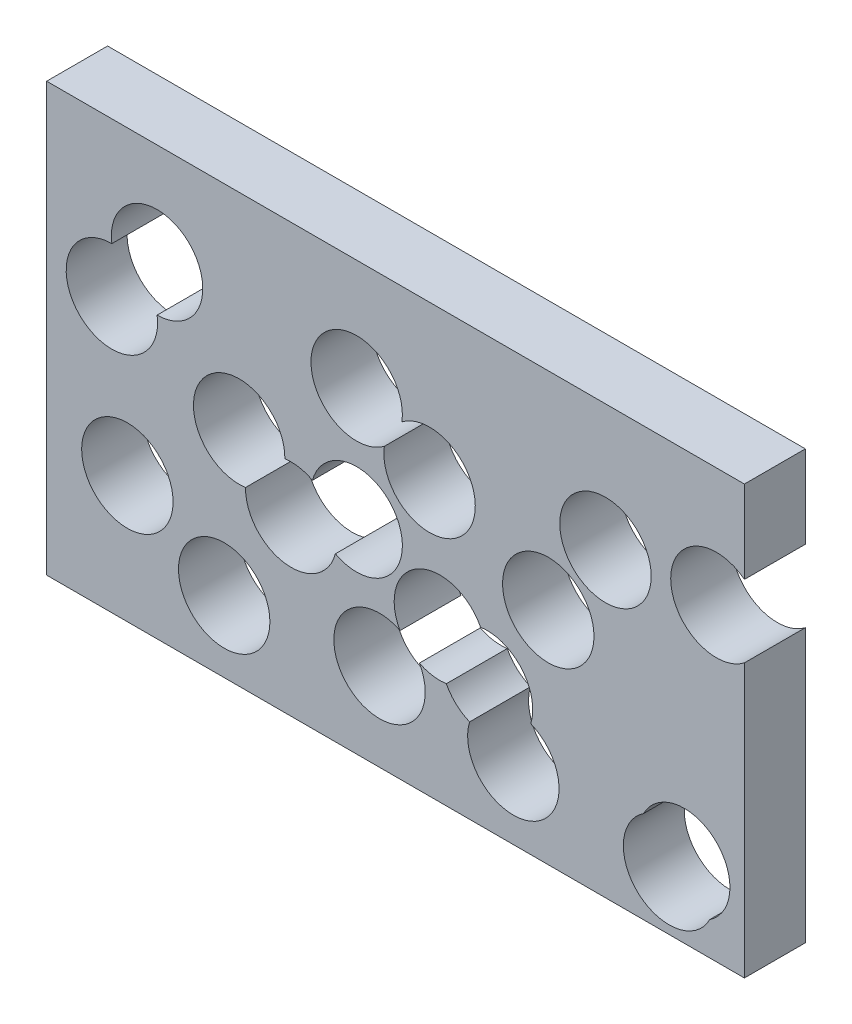
ISO-10303-21;
HEADER;
FILE_DESCRIPTION(('STEP AP214'),'2;1');
FILE_NAME('part.step','',(''),(''),'','','');
FILE_SCHEMA(('AUTOMOTIVE_DESIGN { 1 0 10303 214 1 1 1 1 }'));
ENDSEC;
DATA;
#1=APPLICATION_CONTEXT('core data for automotive mechanical design processes');
#2=APPLICATION_PROTOCOL_DEFINITION('international standard','automotive_design',2000,#1);
#3=PRODUCT_CONTEXT('',#1,'mechanical');
#4=PRODUCT('Part','Part','',(#3));
#5=PRODUCT_RELATED_PRODUCT_CATEGORY('part','',(#4));
#6=PRODUCT_DEFINITION_FORMATION('','',#4);
#7=PRODUCT_DEFINITION_CONTEXT('part definition',#1,'design');
#8=PRODUCT_DEFINITION('design','',#6,#7);
#9=PRODUCT_DEFINITION_SHAPE('','',#8);
#10=(LENGTH_UNIT() NAMED_UNIT(*) SI_UNIT(.MILLI.,.METRE.));
#11=(NAMED_UNIT(*) PLANE_ANGLE_UNIT() SI_UNIT($,.RADIAN.));
#12=(NAMED_UNIT(*) SI_UNIT($,.STERADIAN.) SOLID_ANGLE_UNIT());
#13=UNCERTAINTY_MEASURE_WITH_UNIT(LENGTH_MEASURE(1.E-05),#10,'distance_accuracy_value','');
#14=(GEOMETRIC_REPRESENTATION_CONTEXT(3) GLOBAL_UNCERTAINTY_ASSIGNED_CONTEXT((#13)) GLOBAL_UNIT_ASSIGNED_CONTEXT((#10,
#11,#12)) REPRESENTATION_CONTEXT('',''));
#15=CARTESIAN_POINT('',(0.,0.,0.));
#16=DIRECTION('',(0.,0.,1.));
#17=DIRECTION('',(1.,0.,0.));
#18=AXIS2_PLACEMENT_3D('',#15,#16,#17);
#19=CARTESIAN_POINT('',(57.2495238095238,35.1009523809524,10.));
#20=DIRECTION('',(-1.,0.,0.));
#21=DIRECTION('',(0.,0.,1.));
#22=AXIS2_PLACEMENT_3D('',#19,#20,#21);
#23=PLANE('',#22);
#24=DIRECTION('',(0.,1.,0.));
#25=VECTOR('',#24,1.);
#26=CARTESIAN_POINT('',(57.2495238095238,35.1009523809524,10.));
#27=LINE('',#26,#25);
#28=CARTESIAN_POINT('',(57.2495238095238,21.5401717013044,10.));
#29=VERTEX_POINT('',#28);
#30=CARTESIAN_POINT('',(57.2495238095238,35.1009523809524,10.));
#31=VERTEX_POINT('',#30);
#32=EDGE_CURVE('E203',#29,#31,#27,.T.);
#33=ORIENTED_EDGE('',*,*,#32,.F.);
#34=DIRECTION('',(0.,0.,-1.));
#35=VECTOR('',#34,1.);
#36=CARTESIAN_POINT('',(57.2495238095238,21.5401717013044,10.001));
#37=LINE('',#36,#35);
#38=CARTESIAN_POINT('',(57.2495238095238,21.5401717013044,0.));
#39=VERTEX_POINT('',#38);
#40=EDGE_CURVE('E188',#39,#29,#37,.F.);
#41=ORIENTED_EDGE('',*,*,#40,.F.);
#42=DIRECTION('',(0.,1.,0.));
#43=VECTOR('',#42,1.);
#44=CARTESIAN_POINT('',(57.2495238095238,35.1009523809524,0.));
#45=LINE('',#44,#43);
#46=CARTESIAN_POINT('',(57.2495238095238,35.1009523809524,0.));
#47=VERTEX_POINT('',#46);
#48=EDGE_CURVE('E201',#39,#47,#45,.T.);
#49=ORIENTED_EDGE('',*,*,#48,.T.);
#50=DIRECTION('',(0.,0.,-1.));
#51=VECTOR('',#50,1.);
#52=CARTESIAN_POINT('',(57.2495238095238,35.1009523809524,10.));
#53=LINE('',#52,#51);
#54=EDGE_CURVE('E11',#31,#47,#53,.T.);
#55=ORIENTED_EDGE('',*,*,#54,.F.);
#56=EDGE_LOOP('',(#33,#41,#49,#55));
#57=FACE_BOUND('',#56,.T.);
#58=ADVANCED_FACE('F35',(#57),#23,.F.);
#59=CARTESIAN_POINT('',(57.2495238095238,-35.1009523809524,0.));
#60=VERTEX_POINT('',#59);
#61=CARTESIAN_POINT('',(57.2495238095238,9.68335180796288,0.));
#62=VERTEX_POINT('',#61);
#63=EDGE_CURVE('E208',#60,#62,#45,.T.);
#64=ORIENTED_EDGE('',*,*,#63,.T.);
#65=DIRECTION('',(0.,0.,-1.));
#66=VECTOR('',#65,1.);
#67=CARTESIAN_POINT('',(57.2495238095238,9.68335180796288,10.001));
#68=LINE('',#67,#66);
#69=CARTESIAN_POINT('',(57.2495238095238,9.68335180796288,10.));
#70=VERTEX_POINT('',#69);
#71=EDGE_CURVE('E191',#70,#62,#68,.T.);
#72=ORIENTED_EDGE('',*,*,#71,.F.);
#73=CARTESIAN_POINT('',(57.2495238095238,-35.1009523809524,10.));
#74=VERTEX_POINT('',#73);
#75=EDGE_CURVE('E245',#74,#70,#27,.T.);
#76=ORIENTED_EDGE('',*,*,#75,.F.);
#77=DIRECTION('',(0.,0.,-1.));
#78=VECTOR('',#77,1.);
#79=CARTESIAN_POINT('',(57.2495238095238,-35.1009523809524,10.));
#80=LINE('',#79,#78);
#81=EDGE_CURVE('E223',#74,#60,#80,.T.);
#82=ORIENTED_EDGE('',*,*,#81,.T.);
#83=EDGE_LOOP('',(#64,#72,#76,#82));
#84=FACE_BOUND('',#83,.T.);
#85=ADVANCED_FACE('F37',(#84),#23,.F.);
#86=CARTESIAN_POINT('',(-57.2495238095238,35.1009523809524,10.));
#87=DIRECTION('',(0.,-1.,0.));
#88=DIRECTION('',(0.,0.,-1.));
#89=AXIS2_PLACEMENT_3D('',#86,#87,#88);
#90=PLANE('',#89);
#91=DIRECTION('',(-1.,0.,0.));
#92=VECTOR('',#91,1.);
#93=CARTESIAN_POINT('',(-57.2495238095238,35.1009523809524,0.));
#94=LINE('',#93,#92);
#95=CARTESIAN_POINT('',(-57.2495238095238,35.1009523809524,0.));
#96=VERTEX_POINT('',#95);
#97=EDGE_CURVE('E207',#47,#96,#94,.T.);
#98=ORIENTED_EDGE('',*,*,#97,.T.);
#99=DIRECTION('',(0.,0.,-1.));
#100=VECTOR('',#99,1.);
#101=CARTESIAN_POINT('',(-57.2495238095238,35.1009523809524,10.));
#102=LINE('',#101,#100);
#103=CARTESIAN_POINT('',(-57.2495238095238,35.1009523809524,10.));
#104=VERTEX_POINT('',#103);
#105=EDGE_CURVE('E43',#104,#96,#102,.T.);
#106=ORIENTED_EDGE('',*,*,#105,.F.);
#107=DIRECTION('',(-1.,0.,0.));
#108=VECTOR('',#107,1.);
#109=CARTESIAN_POINT('',(-57.2495238095238,35.1009523809524,10.));
#110=LINE('',#109,#108);
#111=EDGE_CURVE('E247',#31,#104,#110,.T.);
#112=ORIENTED_EDGE('',*,*,#111,.F.);
#113=ORIENTED_EDGE('',*,*,#54,.T.);
#114=EDGE_LOOP('',(#98,#106,#112,#113));
#115=FACE_BOUND('',#114,.T.);
#116=ADVANCED_FACE('F435',(#115),#90,.F.);
#117=CARTESIAN_POINT('',(-57.2495238095238,35.1009523809524,10.));
#118=DIRECTION('',(1.,0.,0.));
#119=DIRECTION('',(0.,0.,-1.));
#120=AXIS2_PLACEMENT_3D('',#117,#118,#119);
#121=PLANE('',#120);
#122=DIRECTION('',(0.,-1.,0.));
#123=VECTOR('',#122,1.);
#124=CARTESIAN_POINT('',(-57.2495238095238,35.1009523809524,0.));
#125=LINE('',#124,#123);
#126=CARTESIAN_POINT('',(-57.2495238095238,-35.1009523809524,0.));
#127=VERTEX_POINT('',#126);
#128=EDGE_CURVE('E219',#96,#127,#125,.T.);
#129=ORIENTED_EDGE('',*,*,#128,.T.);
#130=DIRECTION('',(0.,0.,-1.));
#131=VECTOR('',#130,1.);
#132=CARTESIAN_POINT('',(-57.2495238095238,-35.1009523809524,10.));
#133=LINE('',#132,#131);
#134=CARTESIAN_POINT('',(-57.2495238095238,-35.1009523809524,10.));
#135=VERTEX_POINT('',#134);
#136=EDGE_CURVE('E226',#135,#127,#133,.T.);
#137=ORIENTED_EDGE('',*,*,#136,.F.);
#138=DIRECTION('',(0.,-1.,0.));
#139=VECTOR('',#138,1.);
#140=CARTESIAN_POINT('',(-57.2495238095238,35.1009523809524,10.));
#141=LINE('',#140,#139);
#142=EDGE_CURVE('E234',#104,#135,#141,.T.);
#143=ORIENTED_EDGE('',*,*,#142,.F.);
#144=ORIENTED_EDGE('',*,*,#105,.T.);
#145=EDGE_LOOP('',(#129,#137,#143,#144));
#146=FACE_BOUND('',#145,.T.);
#147=ADVANCED_FACE('F232',(#146),#121,.F.);
#148=CARTESIAN_POINT('',(-57.2495238095238,-35.1009523809524,10.));
#149=DIRECTION('',(0.,1.,0.));
#150=DIRECTION('',(0.,0.,1.));
#151=AXIS2_PLACEMENT_3D('',#148,#149,#150);
#152=PLANE('',#151);
#153=DIRECTION('',(1.,0.,0.));
#154=VECTOR('',#153,1.);
#155=CARTESIAN_POINT('',(-57.2495238095238,-35.1009523809524,0.));
#156=LINE('',#155,#154);
#157=EDGE_CURVE('E221',#127,#60,#156,.T.);
#158=ORIENTED_EDGE('',*,*,#157,.T.);
#159=ORIENTED_EDGE('',*,*,#81,.F.);
#160=DIRECTION('',(1.,0.,0.));
#161=VECTOR('',#160,1.);
#162=CARTESIAN_POINT('',(-57.2495238095238,-35.1009523809524,10.));
#163=LINE('',#162,#161);
#164=EDGE_CURVE('E216',#135,#74,#163,.T.);
#165=ORIENTED_EDGE('',*,*,#164,.F.);
#166=ORIENTED_EDGE('',*,*,#136,.T.);
#167=EDGE_LOOP('',(#158,#159,#165,#166));
#168=FACE_BOUND('',#167,.T.);
#169=ADVANCED_FACE('F240',(#168),#152,.F.);
#170=CARTESIAN_POINT('',(0.,0.,10.));
#171=DIRECTION('',(0.,0.,1.));
#172=DIRECTION('',(1.,0.,0.));
#173=AXIS2_PLACEMENT_3D('',#170,#171,#172);
#174=PLANE('',#173);
#175=CARTESIAN_POINT('',(-6.37811975242641,-1.73626840476659,10.));
#176=DIRECTION('',(0.,0.,1.));
#177=DIRECTION('',(1.,0.,0.));
#178=AXIS2_PLACEMENT_3D('',#175,#176,#177);
#179=CIRCLE('',#178,7.5);
#180=CARTESIAN_POINT('',(-13.6251944971633,0.195028476656942,10.));
#181=VERTEX_POINT('',#180);
#182=CARTESIAN_POINT('',(-9.86943432237123,-8.37409354359716,10.));
#183=VERTEX_POINT('',#182);
#184=EDGE_CURVE('E344',#181,#183,#179,.F.);
#185=ORIENTED_EDGE('',*,*,#184,.T.);
#186=CARTESIAN_POINT('',(-17.1165090671082,-6.44279666217362,10.));
#187=DIRECTION('',(0.,0.,1.));
#188=DIRECTION('',(1.,0.,0.));
#189=AXIS2_PLACEMENT_3D('',#186,#187,#188);
#190=CIRCLE('',#189,7.5);
#191=CARTESIAN_POINT('',(-24.6155820125476,-6.32487737207429,10.));
#192=VERTEX_POINT('',#191);
#193=EDGE_CURVE('E295',#183,#192,#190,.F.);
#194=ORIENTED_EDGE('',*,*,#193,.T.);
#195=CARTESIAN_POINT('',(-25.6587398871773,1.10222311523556,10.));
#196=DIRECTION('',(0.,0.,1.));
#197=DIRECTION('',(1.,0.,0.));
#198=AXIS2_PLACEMENT_3D('',#195,#196,#197);
#199=CIRCLE('',#198,7.5);
#200=CARTESIAN_POINT('',(-18.1596669417378,0.984303825136227,10.));
#201=VERTEX_POINT('',#200);
#202=EDGE_CURVE('E351',#192,#201,#199,.F.);
#203=ORIENTED_EDGE('',*,*,#202,.T.);
#204=EDGE_CURVE('E299',#201,#181,#190,.F.);
#205=ORIENTED_EDGE('',*,*,#204,.T.);
#206=EDGE_LOOP('',(#185,#194,#203,#205));
#207=FACE_BOUND('',#206,.T.);
#208=CARTESIAN_POINT('',(-28.11657925389,-23.41531454247,10.));
#209=DIRECTION('',(0.,0.,1.));
#210=DIRECTION('',(1.,0.,0.));
#211=AXIS2_PLACEMENT_3D('',#208,#209,#210);
#212=CIRCLE('',#211,7.5);
#213=CARTESIAN_POINT('',(-20.61657925389,-23.41531454247,10.));
#214=VERTEX_POINT('',#213);
#215=EDGE_CURVE('E302',#214,#214,#212,.F.);
#216=ORIENTED_EDGE('',*,*,#215,.T.);
#217=EDGE_LOOP('',(#216));
#218=FACE_BOUND('',#217,.T.);
#219=CARTESIAN_POINT('',(5.58806013100366,9.8642464643186,10.));
#220=DIRECTION('',(0.,0.,1.));
#221=DIRECTION('',(1.,0.,0.));
#222=AXIS2_PLACEMENT_3D('',#219,#220,#221);
#223=CIRCLE('',#222,7.5);
#224=CARTESIAN_POINT('',(1.04792712583284,15.8339359282153,10.));
#225=VERTEX_POINT('',#224);
#226=CARTESIAN_POINT('',(-1.8379867472556,10.9148785416396,10.));
#227=VERTEX_POINT('',#226);
#228=EDGE_CURVE('E309',#225,#227,#223,.F.);
#229=ORIENTED_EDGE('',*,*,#228,.T.);
#230=CARTESIAN_POINT('',(-6.37811975242641,16.8845680055363,10.));
#231=DIRECTION('',(0.,0.,1.));
#232=DIRECTION('',(1.,0.,0.));
#233=AXIS2_PLACEMENT_3D('',#230,#231,#232);
#234=CIRCLE('',#233,7.5);
#235=EDGE_CURVE('E308',#227,#225,#234,.F.);
#236=ORIENTED_EDGE('',*,*,#235,.T.);
#237=EDGE_LOOP('',(#229,#236));
#238=FACE_BOUND('',#237,.T.);
#239=CARTESIAN_POINT('',(-2.62543649779445,-20.6900673575785,10.));
#240=DIRECTION('',(0.,0.,1.));
#241=DIRECTION('',(1.,0.,0.));
#242=AXIS2_PLACEMENT_3D('',#239,#240,#241);
#243=CIRCLE('',#242,7.5);
#244=CARTESIAN_POINT('',(3.91205914515111,-17.0143156360299,10.));
#245=VERTEX_POINT('',#244);
#246=CARTESIAN_POINT('',(0.737175091515075,-13.9861249876411,10.));
#247=VERTEX_POINT('',#246);
#248=EDGE_CURVE('E271',#245,#247,#243,.F.);
#249=ORIENTED_EDGE('',*,*,#248,.T.);
#250=CARTESIAN_POINT('',(7.27467073446064,-10.3103732660925,10.));
#251=DIRECTION('',(0.,0.,1.));
#252=DIRECTION('',(1.,0.,0.));
#253=AXIS2_PLACEMENT_3D('',#250,#251,#252);
#254=CIRCLE('',#253,7.5);
#255=CARTESIAN_POINT('',(13.9523428489389,-6.89589012343101,10.));
#256=VERTEX_POINT('',#255);
#257=EDGE_CURVE('E356',#247,#256,#254,.F.);
#258=ORIENTED_EDGE('',*,*,#257,.T.);
#259=CARTESIAN_POINT('',(15.015158953517,-14.320203016073,10.));
#260=DIRECTION('',(0.,0.,1.));
#261=DIRECTION('',(1.,0.,0.));
#262=AXIS2_PLACEMENT_3D('',#259,#260,#261);
#263=CIRCLE('',#262,7.5);
#264=CARTESIAN_POINT('',(22.1963377977065,-16.4836887238522,10.));
#265=VERTEX_POINT('',#264);
#266=EDGE_CURVE('E274',#256,#265,#263,.F.);
#267=ORIENTED_EDGE('',*,*,#266,.T.);
#268=CARTESIAN_POINT('',(19.33232601165,-23.41531454247,10.));
#269=DIRECTION('',(0.,0.,1.));
#270=DIRECTION('',(1.,0.,0.));
#271=AXIS2_PLACEMENT_3D('',#268,#269,#270);
#272=CIRCLE('',#271,7.5);
#273=CARTESIAN_POINT('',(12.1511471674605,-21.2518288346908,10.));
#274=VERTEX_POINT('',#273);
#275=EDGE_CURVE('E381',#265,#274,#272,.F.);
#276=ORIENTED_EDGE('',*,*,#275,.T.);
#277=CARTESIAN_POINT('',(8.33748683903877,-17.7346861587345,10.));
#278=VERTEX_POINT('',#277);
#279=EDGE_CURVE('E277',#274,#278,#263,.F.);
#280=ORIENTED_EDGE('',*,*,#279,.T.);
#281=EDGE_CURVE('E363',#278,#245,#254,.F.);
#282=ORIENTED_EDGE('',*,*,#281,.T.);
#283=EDGE_LOOP('',(#249,#258,#267,#276,#280,#282));
#284=FACE_BOUND('',#283,.T.);
#285=CARTESIAN_POINT('',(25.0643763625362,1.10222311523556,10.));
#286=DIRECTION('',(0.,0.,1.));
#287=DIRECTION('',(1.,0.,0.));
#288=AXIS2_PLACEMENT_3D('',#285,#286,#287);
#289=CIRCLE('',#288,7.5);
#290=CARTESIAN_POINT('',(32.5643763625362,1.10222311523556,10.));
#291=VERTEX_POINT('',#290);
#292=EDGE_CURVE('E281',#291,#291,#289,.F.);
#293=ORIENTED_EDGE('',*,*,#292,.T.);
#294=EDGE_LOOP('',(#293));
#295=FACE_BOUND('',#294,.T.);
#296=CARTESIAN_POINT('',(-46.5466126384086,9.8642464643186,10.));
#297=DIRECTION('',(0.,0.,1.));
#298=DIRECTION('',(1.,0.,0.));
#299=AXIS2_PLACEMENT_3D('',#296,#297,#298);
#300=CIRCLE('',#299,7.5);
#301=CARTESIAN_POINT('',(-39.1221660169778,10.926127985734,10.));
#302=VERTEX_POINT('',#301);
#303=CARTESIAN_POINT('',(-46.5536541103431,17.3642431588294,10.));
#304=VERTEX_POINT('',#303);
#305=EDGE_CURVE('E288',#302,#304,#300,.F.);
#306=ORIENTED_EDGE('',*,*,#305,.T.);
#307=CARTESIAN_POINT('',(-39.1292074889122,18.4261246802448,10.));
#308=DIRECTION('',(0.,0.,1.));
#309=DIRECTION('',(1.,0.,0.));
#310=AXIS2_PLACEMENT_3D('',#307,#308,#309);
#311=CIRCLE('',#310,7.5);
#312=EDGE_CURVE('E369',#304,#302,#311,.F.);
#313=ORIENTED_EDGE('',*,*,#312,.T.);
#314=EDGE_LOOP('',(#306,#313));
#315=FACE_BOUND('',#314,.T.);
#316=CARTESIAN_POINT('',(-44.0083467409096,-14.320203016073,10.));
#317=DIRECTION('',(0.,0.,1.));
#318=DIRECTION('',(1.,0.,0.));
#319=AXIS2_PLACEMENT_3D('',#316,#317,#318);
#320=CIRCLE('',#319,7.5);
#321=CARTESIAN_POINT('',(-36.5083467409096,-14.320203016073,10.));
#322=VERTEX_POINT('',#321);
#323=EDGE_CURVE('E375',#322,#322,#320,.F.);
#324=ORIENTED_EDGE('',*,*,#323,.T.);
#325=EDGE_LOOP('',(#324));
#326=FACE_BOUND('',#325,.T.);
#327=CARTESIAN_POINT('',(52.6556196415839,15.6117617546336,10.));
#328=DIRECTION('',(0.,0.,1.));
#329=DIRECTION('',(1.,0.,0.));
#330=AXIS2_PLACEMENT_3D('',#327,#328,#329);
#331=CIRCLE('',#330,7.5);
#332=EDGE_CURVE('E196',#70,#29,#331,.F.);
#333=ORIENTED_EDGE('',*,*,#332,.T.);
#334=ORIENTED_EDGE('',*,*,#32,.T.);
#335=ORIENTED_EDGE('',*,*,#111,.T.);
#336=ORIENTED_EDGE('',*,*,#142,.T.);
#337=ORIENTED_EDGE('',*,*,#164,.T.);
#338=ORIENTED_EDGE('',*,*,#75,.T.);
#339=EDGE_LOOP('',(#333,#334,#335,#336,#337,#338));
#340=FACE_BOUND('',#339,.T.);
#341=CARTESIAN_POINT('',(47.3771788451103,-23.41531454247,10.));
#342=DIRECTION('',(0.,0.,1.));
#343=DIRECTION('',(1.,0.,0.));
#344=AXIS2_PLACEMENT_3D('',#341,#342,#343);
#345=CIRCLE('',#344,7.5);
#346=CARTESIAN_POINT('',(40.6984907266272,-20.0028191188785,10.));
#347=VERTEX_POINT('',#346);
#348=CARTESIAN_POINT('',(51.5635590836743,-29.6381933375424,10.));
#349=VERTEX_POINT('',#348);
#350=EDGE_CURVE('E259',#347,#349,#345,.F.);
#351=ORIENTED_EDGE('',*,*,#350,.T.);
#352=CARTESIAN_POINT('',(44.8848709651912,-26.2256979139508,10.));
#353=DIRECTION('',(0.,0.,1.));
#354=DIRECTION('',(1.,0.,0.));
#355=AXIS2_PLACEMENT_3D('',#352,#353,#354);
#356=CIRCLE('',#355,7.5);
#357=EDGE_CURVE('E212',#349,#347,#356,.F.);
#358=ORIENTED_EDGE('',*,*,#357,.T.);
#359=EDGE_LOOP('',(#351,#358));
#360=FACE_BOUND('',#359,.T.);
#361=CARTESIAN_POINT('',(34.4532392573882,14.333373686348,10.));
#362=DIRECTION('',(0.,0.,1.));
#363=DIRECTION('',(1.,0.,0.));
#364=AXIS2_PLACEMENT_3D('',#361,#362,#363);
#365=CIRCLE('',#364,7.5);
#366=CARTESIAN_POINT('',(41.9532392573882,14.333373686348,10.));
#367=VERTEX_POINT('',#366);
#368=EDGE_CURVE('E263',#367,#367,#365,.F.);
#369=ORIENTED_EDGE('',*,*,#368,.T.);
#370=EDGE_LOOP('',(#369));
#371=FACE_BOUND('',#370,.T.);
#372=ADVANCED_FACE('F251',(#207,#218,#238,#284,#295,#315,#326,#340,#360,#371),#174,.T.);
#373=CARTESIAN_POINT('',(0.,0.,0.));
#374=DIRECTION('',(0.,0.,1.));
#375=DIRECTION('',(1.,0.,0.));
#376=AXIS2_PLACEMENT_3D('',#373,#374,#375);
#377=PLANE('',#376);
#378=CARTESIAN_POINT('',(-17.1165090671082,-6.44279666217362,0.));
#379=DIRECTION('',(0.,0.,-1.));
#380=DIRECTION('',(-1.,0.,0.));
#381=AXIS2_PLACEMENT_3D('',#378,#379,#380);
#382=CIRCLE('',#381,7.5);
#383=CARTESIAN_POINT('',(-9.86943432237123,-8.37409354359716,0.));
#384=VERTEX_POINT('',#383);
#385=CARTESIAN_POINT('',(-24.6155820125476,-6.32487737207429,0.));
#386=VERTEX_POINT('',#385);
#387=EDGE_CURVE('E298',#384,#386,#382,.T.);
#388=ORIENTED_EDGE('',*,*,#387,.F.);
#389=CARTESIAN_POINT('',(-6.37811975242641,-1.73626840476659,0.));
#390=DIRECTION('',(0.,0.,-1.));
#391=DIRECTION('',(-1.,0.,0.));
#392=AXIS2_PLACEMENT_3D('',#389,#390,#391);
#393=CIRCLE('',#392,7.5);
#394=CARTESIAN_POINT('',(-13.6251944971633,0.195028476656942,0.));
#395=VERTEX_POINT('',#394);
#396=EDGE_CURVE('E347',#395,#384,#393,.T.);
#397=ORIENTED_EDGE('',*,*,#396,.F.);
#398=CARTESIAN_POINT('',(-18.1596669417378,0.984303825136227,0.));
#399=VERTEX_POINT('',#398);
#400=EDGE_CURVE('E301',#399,#395,#382,.T.);
#401=ORIENTED_EDGE('',*,*,#400,.F.);
#402=CARTESIAN_POINT('',(-25.6587398871773,1.10222311523556,0.));
#403=DIRECTION('',(0.,0.,-1.));
#404=DIRECTION('',(-1.,0.,0.));
#405=AXIS2_PLACEMENT_3D('',#402,#403,#404);
#406=CIRCLE('',#405,7.5);
#407=EDGE_CURVE('E343',#386,#399,#406,.T.);
#408=ORIENTED_EDGE('',*,*,#407,.F.);
#409=EDGE_LOOP('',(#388,#397,#401,#408));
#410=FACE_BOUND('',#409,.T.);
#411=CARTESIAN_POINT('',(-28.11657925389,-23.41531454247,0.));
#412=DIRECTION('',(0.,0.,-1.));
#413=DIRECTION('',(-1.,0.,0.));
#414=AXIS2_PLACEMENT_3D('',#411,#412,#413);
#415=CIRCLE('',#414,7.5);
#416=CARTESIAN_POINT('',(-35.61657925389,-23.41531454247,0.));
#417=VERTEX_POINT('',#416);
#418=EDGE_CURVE('E305',#417,#417,#415,.T.);
#419=ORIENTED_EDGE('',*,*,#418,.F.);
#420=EDGE_LOOP('',(#419));
#421=FACE_BOUND('',#420,.T.);
#422=CARTESIAN_POINT('',(-6.37811975242641,16.8845680055363,0.));
#423=DIRECTION('',(0.,0.,-1.));
#424=DIRECTION('',(-1.,0.,0.));
#425=AXIS2_PLACEMENT_3D('',#422,#423,#424);
#426=CIRCLE('',#425,7.5);
#427=CARTESIAN_POINT('',(-1.8379867472556,10.9148785416396,0.));
#428=VERTEX_POINT('',#427);
#429=CARTESIAN_POINT('',(1.04792712583284,15.8339359282153,0.));
#430=VERTEX_POINT('',#429);
#431=EDGE_CURVE('E316',#428,#430,#426,.T.);
#432=ORIENTED_EDGE('',*,*,#431,.F.);
#433=CARTESIAN_POINT('',(5.58806013100366,9.8642464643186,0.));
#434=DIRECTION('',(0.,0.,-1.));
#435=DIRECTION('',(-1.,0.,0.));
#436=AXIS2_PLACEMENT_3D('',#433,#434,#435);
#437=CIRCLE('',#436,7.5);
#438=EDGE_CURVE('E278',#430,#428,#437,.T.);
#439=ORIENTED_EDGE('',*,*,#438,.F.);
#440=EDGE_LOOP('',(#432,#439));
#441=FACE_BOUND('',#440,.T.);
#442=CARTESIAN_POINT('',(7.27467073446064,-10.3103732660925,0.));
#443=DIRECTION('',(0.,0.,-1.));
#444=DIRECTION('',(-1.,0.,0.));
#445=AXIS2_PLACEMENT_3D('',#442,#443,#444);
#446=CIRCLE('',#445,7.5);
#447=CARTESIAN_POINT('',(0.737175091515075,-13.9861249876411,0.));
#448=VERTEX_POINT('',#447);
#449=CARTESIAN_POINT('',(13.9523428489389,-6.89589012343101,0.));
#450=VERTEX_POINT('',#449);
#451=EDGE_CURVE('E366',#448,#450,#446,.T.);
#452=ORIENTED_EDGE('',*,*,#451,.F.);
#453=CARTESIAN_POINT('',(-2.62543649779445,-20.6900673575785,0.));
#454=DIRECTION('',(0.,0.,-1.));
#455=DIRECTION('',(-1.,0.,0.));
#456=AXIS2_PLACEMENT_3D('',#453,#454,#455);
#457=CIRCLE('',#456,7.5);
#458=CARTESIAN_POINT('',(3.91205914515111,-17.0143156360299,0.));
#459=VERTEX_POINT('',#458);
#460=EDGE_CURVE('E266',#459,#448,#457,.T.);
#461=ORIENTED_EDGE('',*,*,#460,.F.);
#462=CARTESIAN_POINT('',(8.33748683903877,-17.7346861587345,0.));
#463=VERTEX_POINT('',#462);
#464=EDGE_CURVE('E348',#463,#459,#446,.T.);
#465=ORIENTED_EDGE('',*,*,#464,.F.);
#466=CARTESIAN_POINT('',(15.015158953517,-14.320203016073,0.));
#467=DIRECTION('',(0.,0.,-1.));
#468=DIRECTION('',(-1.,0.,0.));
#469=AXIS2_PLACEMENT_3D('',#466,#467,#468);
#470=CIRCLE('',#469,7.5);
#471=CARTESIAN_POINT('',(12.1511471674605,-21.2518288346908,0.));
#472=VERTEX_POINT('',#471);
#473=EDGE_CURVE('E282',#472,#463,#470,.T.);
#474=ORIENTED_EDGE('',*,*,#473,.F.);
#475=CARTESIAN_POINT('',(19.33232601165,-23.41531454247,0.));
#476=DIRECTION('',(0.,0.,-1.));
#477=DIRECTION('',(-1.,0.,0.));
#478=AXIS2_PLACEMENT_3D('',#475,#476,#477);
#479=CIRCLE('',#478,7.5);
#480=CARTESIAN_POINT('',(22.1963377977065,-16.4836887238522,0.));
#481=VERTEX_POINT('',#480);
#482=EDGE_CURVE('E384',#481,#472,#479,.T.);
#483=ORIENTED_EDGE('',*,*,#482,.F.);
#484=EDGE_CURVE('E279',#450,#481,#470,.T.);
#485=ORIENTED_EDGE('',*,*,#484,.F.);
#486=EDGE_LOOP('',(#452,#461,#465,#474,#483,#485));
#487=FACE_BOUND('',#486,.T.);
#488=CARTESIAN_POINT('',(25.0643763625362,1.10222311523556,0.));
#489=DIRECTION('',(0.,0.,-1.));
#490=DIRECTION('',(-1.,0.,0.));
#491=AXIS2_PLACEMENT_3D('',#488,#489,#490);
#492=CIRCLE('',#491,7.5);
#493=CARTESIAN_POINT('',(17.5643763625362,1.10222311523556,0.));
#494=VERTEX_POINT('',#493);
#495=EDGE_CURVE('E285',#494,#494,#492,.T.);
#496=ORIENTED_EDGE('',*,*,#495,.F.);
#497=EDGE_LOOP('',(#496));
#498=FACE_BOUND('',#497,.T.);
#499=CARTESIAN_POINT('',(-39.1292074889122,18.4261246802448,0.));
#500=DIRECTION('',(0.,0.,-1.));
#501=DIRECTION('',(-1.,0.,0.));
#502=AXIS2_PLACEMENT_3D('',#499,#500,#501);
#503=CIRCLE('',#502,7.5);
#504=CARTESIAN_POINT('',(-46.5536541103431,17.3642431588294,0.));
#505=VERTEX_POINT('',#504);
#506=CARTESIAN_POINT('',(-39.1221660169778,10.926127985734,0.));
#507=VERTEX_POINT('',#506);
#508=EDGE_CURVE('E372',#505,#507,#503,.T.);
#509=ORIENTED_EDGE('',*,*,#508,.F.);
#510=CARTESIAN_POINT('',(-46.5466126384086,9.8642464643186,0.));
#511=DIRECTION('',(0.,0.,-1.));
#512=DIRECTION('',(-1.,0.,0.));
#513=AXIS2_PLACEMENT_3D('',#510,#511,#512);
#514=CIRCLE('',#513,7.5);
#515=EDGE_CURVE('E291',#507,#505,#514,.T.);
#516=ORIENTED_EDGE('',*,*,#515,.F.);
#517=EDGE_LOOP('',(#509,#516));
#518=FACE_BOUND('',#517,.T.);
#519=CARTESIAN_POINT('',(-44.0083467409096,-14.320203016073,0.));
#520=DIRECTION('',(0.,0.,-1.));
#521=DIRECTION('',(-1.,0.,0.));
#522=AXIS2_PLACEMENT_3D('',#519,#520,#521);
#523=CIRCLE('',#522,7.5);
#524=CARTESIAN_POINT('',(-51.5083467409096,-14.320203016073,0.));
#525=VERTEX_POINT('',#524);
#526=EDGE_CURVE('E378',#525,#525,#523,.T.);
#527=ORIENTED_EDGE('',*,*,#526,.F.);
#528=EDGE_LOOP('',(#527));
#529=FACE_BOUND('',#528,.T.);
#530=CARTESIAN_POINT('',(34.4532392573882,14.333373686348,0.));
#531=DIRECTION('',(0.,0.,-1.));
#532=DIRECTION('',(-1.,0.,0.));
#533=AXIS2_PLACEMENT_3D('',#530,#531,#532);
#534=CIRCLE('',#533,7.5);
#535=CARTESIAN_POINT('',(26.9532392573882,14.333373686348,0.));
#536=VERTEX_POINT('',#535);
#537=EDGE_CURVE('E265',#536,#536,#534,.T.);
#538=ORIENTED_EDGE('',*,*,#537,.F.);
#539=EDGE_LOOP('',(#538));
#540=FACE_BOUND('',#539,.T.);
#541=CARTESIAN_POINT('',(44.8848709651912,-26.2256979139508,0.));
#542=DIRECTION('',(0.,0.,-1.));
#543=DIRECTION('',(-1.,0.,0.));
#544=AXIS2_PLACEMENT_3D('',#541,#542,#543);
#545=CIRCLE('',#544,7.5);
#546=CARTESIAN_POINT('',(51.5635590836743,-29.6381933375424,0.));
#547=VERTEX_POINT('',#546);
#548=CARTESIAN_POINT('',(40.6984907266272,-20.0028191188785,0.));
#549=VERTEX_POINT('',#548);
#550=EDGE_CURVE('E209',#547,#549,#545,.T.);
#551=ORIENTED_EDGE('',*,*,#550,.F.);
#552=CARTESIAN_POINT('',(47.3771788451103,-23.41531454247,0.));
#553=DIRECTION('',(0.,0.,-1.));
#554=DIRECTION('',(-1.,0.,0.));
#555=AXIS2_PLACEMENT_3D('',#552,#553,#554);
#556=CIRCLE('',#555,7.5);
#557=EDGE_CURVE('E357',#549,#547,#556,.T.);
#558=ORIENTED_EDGE('',*,*,#557,.F.);
#559=EDGE_LOOP('',(#551,#558));
#560=FACE_BOUND('',#559,.T.);
#561=ORIENTED_EDGE('',*,*,#48,.F.);
#562=CARTESIAN_POINT('',(52.6556196415839,15.6117617546336,0.));
#563=DIRECTION('',(0.,0.,-1.));
#564=DIRECTION('',(-1.,0.,0.));
#565=AXIS2_PLACEMENT_3D('',#562,#563,#564);
#566=CIRCLE('',#565,7.5);
#567=EDGE_CURVE('E185',#62,#39,#566,.T.);
#568=ORIENTED_EDGE('',*,*,#567,.F.);
#569=ORIENTED_EDGE('',*,*,#63,.F.);
#570=ORIENTED_EDGE('',*,*,#157,.F.);
#571=ORIENTED_EDGE('',*,*,#128,.F.);
#572=ORIENTED_EDGE('',*,*,#97,.F.);
#573=EDGE_LOOP('',(#561,#568,#569,#570,#571,#572));
#574=FACE_BOUND('',#573,.T.);
#575=ADVANCED_FACE('F205',(#410,#421,#441,#487,#498,#518,#529,#540,#560,#574),#377,.F.);
#576=CARTESIAN_POINT('',(44.8848709651912,-26.2256979139508,10.001));
#577=DIRECTION('',(0.,0.,-1.));
#578=DIRECTION('',(-1.,0.,0.));
#579=AXIS2_PLACEMENT_3D('',#576,#577,#578);
#580=CYLINDRICAL_SURFACE('',#579,7.5);
#581=ORIENTED_EDGE('',*,*,#357,.F.);
#582=DIRECTION('',(0.,0.,-1.));
#583=VECTOR('',#582,1.);
#584=CARTESIAN_POINT('',(51.5635590836743,-29.6381933375424,5.));
#585=LINE('',#584,#583);
#586=EDGE_CURVE('E361',#547,#349,#585,.F.);
#587=ORIENTED_EDGE('',*,*,#586,.F.);
#588=ORIENTED_EDGE('',*,*,#550,.T.);
#589=DIRECTION('',(0.,0.,-1.));
#590=VECTOR('',#589,1.);
#591=CARTESIAN_POINT('',(40.6984907266272,-20.0028191188785,5.));
#592=LINE('',#591,#590);
#593=EDGE_CURVE('E359',#347,#549,#592,.T.);
#594=ORIENTED_EDGE('',*,*,#593,.F.);
#595=EDGE_LOOP('',(#581,#587,#588,#594));
#596=FACE_BOUND('',#595,.T.);
#597=ADVANCED_FACE('F447',(#596),#580,.F.);
#598=CARTESIAN_POINT('',(47.3771788451103,-23.41531454247,10.001));
#599=DIRECTION('',(0.,0.,-1.));
#600=DIRECTION('',(-1.,0.,0.));
#601=AXIS2_PLACEMENT_3D('',#598,#599,#600);
#602=CYLINDRICAL_SURFACE('',#601,7.5);
#603=ORIENTED_EDGE('',*,*,#593,.T.);
#604=ORIENTED_EDGE('',*,*,#557,.T.);
#605=ORIENTED_EDGE('',*,*,#586,.T.);
#606=ORIENTED_EDGE('',*,*,#350,.F.);
#607=EDGE_LOOP('',(#603,#604,#605,#606));
#608=FACE_BOUND('',#607,.T.);
#609=ADVANCED_FACE('F451',(#608),#602,.F.);
#610=CARTESIAN_POINT('',(34.4532392573882,14.333373686348,10.001));
#611=DIRECTION('',(0.,0.,-1.));
#612=DIRECTION('',(-1.,0.,0.));
#613=AXIS2_PLACEMENT_3D('',#610,#611,#612);
#614=CYLINDRICAL_SURFACE('',#613,7.5);
#615=ORIENTED_EDGE('',*,*,#368,.F.);
#616=EDGE_LOOP('',(#615));
#617=FACE_BOUND('',#616,.T.);
#618=ORIENTED_EDGE('',*,*,#537,.T.);
#619=EDGE_LOOP('',(#618));
#620=FACE_BOUND('',#619,.T.);
#621=ADVANCED_FACE('F453',(#617,#620),#614,.F.);
#622=CARTESIAN_POINT('',(52.6556196415839,15.6117617546336,10.001));
#623=DIRECTION('',(0.,0.,-1.));
#624=DIRECTION('',(-1.,0.,0.));
#625=AXIS2_PLACEMENT_3D('',#622,#623,#624);
#626=CYLINDRICAL_SURFACE('',#625,7.5);
#627=ORIENTED_EDGE('',*,*,#40,.T.);
#628=ORIENTED_EDGE('',*,*,#332,.F.);
#629=ORIENTED_EDGE('',*,*,#71,.T.);
#630=ORIENTED_EDGE('',*,*,#567,.T.);
#631=EDGE_LOOP('',(#627,#628,#629,#630));
#632=FACE_BOUND('',#631,.T.);
#633=ADVANCED_FACE('F187',(#632),#626,.F.);
#634=CARTESIAN_POINT('',(-44.0083467409096,-14.320203016073,10.001));
#635=DIRECTION('',(0.,0.,-1.));
#636=DIRECTION('',(-1.,0.,0.));
#637=AXIS2_PLACEMENT_3D('',#634,#635,#636);
#638=CYLINDRICAL_SURFACE('',#637,7.5);
#639=ORIENTED_EDGE('',*,*,#323,.F.);
#640=EDGE_LOOP('',(#639));
#641=FACE_BOUND('',#640,.T.);
#642=ORIENTED_EDGE('',*,*,#526,.T.);
#643=EDGE_LOOP('',(#642));
#644=FACE_BOUND('',#643,.T.);
#645=ADVANCED_FACE('F459',(#641,#644),#638,.F.);
#646=CARTESIAN_POINT('',(-46.5466126384086,9.8642464643186,10.001));
#647=DIRECTION('',(0.,0.,-1.));
#648=DIRECTION('',(-1.,0.,0.));
#649=AXIS2_PLACEMENT_3D('',#646,#647,#648);
#650=CYLINDRICAL_SURFACE('',#649,7.5);
#651=DIRECTION('',(0.,0.,-1.));
#652=VECTOR('',#651,1.);
#653=CARTESIAN_POINT('',(-39.1221660169778,10.926127985734,5.));
#654=LINE('',#653,#652);
#655=EDGE_CURVE('E331',#302,#507,#654,.T.);
#656=ORIENTED_EDGE('',*,*,#655,.T.);
#657=ORIENTED_EDGE('',*,*,#515,.T.);
#658=DIRECTION('',(0.,0.,-1.));
#659=VECTOR('',#658,1.);
#660=CARTESIAN_POINT('',(-46.5536541103431,17.3642431588294,5.));
#661=LINE('',#660,#659);
#662=EDGE_CURVE('E333',#505,#304,#661,.F.);
#663=ORIENTED_EDGE('',*,*,#662,.T.);
#664=ORIENTED_EDGE('',*,*,#305,.F.);
#665=EDGE_LOOP('',(#656,#657,#663,#664));
#666=FACE_BOUND('',#665,.T.);
#667=ADVANCED_FACE('F500',(#666),#650,.F.);
#668=CARTESIAN_POINT('',(-39.1292074889122,18.4261246802448,10.001));
#669=DIRECTION('',(0.,0.,-1.));
#670=DIRECTION('',(-1.,0.,0.));
#671=AXIS2_PLACEMENT_3D('',#668,#669,#670);
#672=CYLINDRICAL_SURFACE('',#671,7.5);
#673=ORIENTED_EDGE('',*,*,#312,.F.);
#674=ORIENTED_EDGE('',*,*,#662,.F.);
#675=ORIENTED_EDGE('',*,*,#508,.T.);
#676=ORIENTED_EDGE('',*,*,#655,.F.);
#677=EDGE_LOOP('',(#673,#674,#675,#676));
#678=FACE_BOUND('',#677,.T.);
#679=ADVANCED_FACE('F502',(#678),#672,.F.);
#680=CARTESIAN_POINT('',(25.0643763625362,1.10222311523556,10.001));
#681=DIRECTION('',(0.,0.,-1.));
#682=DIRECTION('',(-1.,0.,0.));
#683=AXIS2_PLACEMENT_3D('',#680,#681,#682);
#684=CYLINDRICAL_SURFACE('',#683,7.5);
#685=ORIENTED_EDGE('',*,*,#292,.F.);
#686=EDGE_LOOP('',(#685));
#687=FACE_BOUND('',#686,.T.);
#688=ORIENTED_EDGE('',*,*,#495,.T.);
#689=EDGE_LOOP('',(#688));
#690=FACE_BOUND('',#689,.T.);
#691=ADVANCED_FACE('F428',(#687,#690),#684,.F.);
#692=CARTESIAN_POINT('',(15.015158953517,-14.320203016073,10.001));
#693=DIRECTION('',(0.,0.,-1.));
#694=DIRECTION('',(-1.,0.,0.));
#695=AXIS2_PLACEMENT_3D('',#692,#693,#694);
#696=CYLINDRICAL_SURFACE('',#695,7.5);
#697=DIRECTION('',(0.,0.,-1.));
#698=VECTOR('',#697,1.);
#699=CARTESIAN_POINT('',(12.1511471674605,-21.2518288346908,5.));
#700=LINE('',#699,#698);
#701=EDGE_CURVE('E327',#274,#472,#700,.T.);
#702=ORIENTED_EDGE('',*,*,#701,.T.);
#703=ORIENTED_EDGE('',*,*,#473,.T.);
#704=DIRECTION('',(0.,0.,-1.));
#705=VECTOR('',#704,1.);
#706=CARTESIAN_POINT('',(8.33748683903877,-17.7346861587345,5.));
#707=LINE('',#706,#705);
#708=EDGE_CURVE('E337',#463,#278,#707,.F.);
#709=ORIENTED_EDGE('',*,*,#708,.T.);
#710=ORIENTED_EDGE('',*,*,#279,.F.);
#711=EDGE_LOOP('',(#702,#703,#709,#710));
#712=FACE_BOUND('',#711,.T.);
#713=ADVANCED_FACE('F408',(#712),#696,.F.);
#714=DIRECTION('',(0.,0.,-1.));
#715=VECTOR('',#714,1.);
#716=CARTESIAN_POINT('',(22.1963377977065,-16.4836887238522,5.));
#717=LINE('',#716,#715);
#718=EDGE_CURVE('E329',#481,#265,#717,.F.);
#719=ORIENTED_EDGE('',*,*,#718,.T.);
#720=ORIENTED_EDGE('',*,*,#266,.F.);
#721=DIRECTION('',(0.,0.,-1.));
#722=VECTOR('',#721,1.);
#723=CARTESIAN_POINT('',(13.9523428489389,-6.89589012343101,5.));
#724=LINE('',#723,#722);
#725=EDGE_CURVE('E335',#256,#450,#724,.T.);
#726=ORIENTED_EDGE('',*,*,#725,.T.);
#727=ORIENTED_EDGE('',*,*,#484,.T.);
#728=EDGE_LOOP('',(#719,#720,#726,#727));
#729=FACE_BOUND('',#728,.T.);
#730=ADVANCED_FACE('F420',(#729),#696,.F.);
#731=CARTESIAN_POINT('',(7.27467073446064,-10.3103732660925,10.001));
#732=DIRECTION('',(0.,0.,-1.));
#733=DIRECTION('',(-1.,0.,0.));
#734=AXIS2_PLACEMENT_3D('',#731,#732,#733);
#735=CYLINDRICAL_SURFACE('',#734,7.5);
#736=ORIENTED_EDGE('',*,*,#257,.F.);
#737=DIRECTION('',(0.,0.,-1.));
#738=VECTOR('',#737,1.);
#739=CARTESIAN_POINT('',(0.737175091515075,-13.9861249876411,5.));
#740=LINE('',#739,#738);
#741=EDGE_CURVE('E341',#448,#247,#740,.F.);
#742=ORIENTED_EDGE('',*,*,#741,.F.);
#743=ORIENTED_EDGE('',*,*,#451,.T.);
#744=ORIENTED_EDGE('',*,*,#725,.F.);
#745=EDGE_LOOP('',(#736,#742,#743,#744));
#746=FACE_BOUND('',#745,.T.);
#747=ADVANCED_FACE('F418',(#746),#735,.F.);
#748=ORIENTED_EDGE('',*,*,#464,.T.);
#749=DIRECTION('',(0.,0.,-1.));
#750=VECTOR('',#749,1.);
#751=CARTESIAN_POINT('',(3.91205914515111,-17.0143156360299,5.));
#752=LINE('',#751,#750);
#753=EDGE_CURVE('E339',#245,#459,#752,.T.);
#754=ORIENTED_EDGE('',*,*,#753,.F.);
#755=ORIENTED_EDGE('',*,*,#281,.F.);
#756=ORIENTED_EDGE('',*,*,#708,.F.);
#757=EDGE_LOOP('',(#748,#754,#755,#756));
#758=FACE_BOUND('',#757,.T.);
#759=ADVANCED_FACE('F411',(#758),#735,.F.);
#760=CARTESIAN_POINT('',(-2.62543649779445,-20.6900673575785,10.001));
#761=DIRECTION('',(0.,0.,-1.));
#762=DIRECTION('',(-1.,0.,0.));
#763=AXIS2_PLACEMENT_3D('',#760,#761,#762);
#764=CYLINDRICAL_SURFACE('',#763,7.5);
#765=ORIENTED_EDGE('',*,*,#753,.T.);
#766=ORIENTED_EDGE('',*,*,#460,.T.);
#767=ORIENTED_EDGE('',*,*,#741,.T.);
#768=ORIENTED_EDGE('',*,*,#248,.F.);
#769=EDGE_LOOP('',(#765,#766,#767,#768));
#770=FACE_BOUND('',#769,.T.);
#771=ADVANCED_FACE('F413',(#770),#764,.F.);
#772=CARTESIAN_POINT('',(19.33232601165,-23.41531454247,10.001));
#773=DIRECTION('',(0.,0.,-1.));
#774=DIRECTION('',(-1.,0.,0.));
#775=AXIS2_PLACEMENT_3D('',#772,#773,#774);
#776=CYLINDRICAL_SURFACE('',#775,7.5);
#777=ORIENTED_EDGE('',*,*,#275,.F.);
#778=ORIENTED_EDGE('',*,*,#718,.F.);
#779=ORIENTED_EDGE('',*,*,#482,.T.);
#780=ORIENTED_EDGE('',*,*,#701,.F.);
#781=EDGE_LOOP('',(#777,#778,#779,#780));
#782=FACE_BOUND('',#781,.T.);
#783=ADVANCED_FACE('F393',(#782),#776,.F.);
#784=CARTESIAN_POINT('',(5.58806013100366,9.8642464643186,10.001));
#785=DIRECTION('',(0.,0.,-1.));
#786=DIRECTION('',(-1.,0.,0.));
#787=AXIS2_PLACEMENT_3D('',#784,#785,#786);
#788=CYLINDRICAL_SURFACE('',#787,7.5);
#789=DIRECTION('',(0.,0.,-1.));
#790=VECTOR('',#789,1.);
#791=CARTESIAN_POINT('',(1.04792712583284,15.8339359282153,5.));
#792=LINE('',#791,#790);
#793=EDGE_CURVE('E58',#225,#430,#792,.T.);
#794=ORIENTED_EDGE('',*,*,#793,.T.);
#795=ORIENTED_EDGE('',*,*,#438,.T.);
#796=DIRECTION('',(0.,0.,-1.));
#797=VECTOR('',#796,1.);
#798=CARTESIAN_POINT('',(-1.8379867472556,10.9148785416396,5.));
#799=LINE('',#798,#797);
#800=EDGE_CURVE('E314',#428,#227,#799,.F.);
#801=ORIENTED_EDGE('',*,*,#800,.T.);
#802=ORIENTED_EDGE('',*,*,#228,.F.);
#803=EDGE_LOOP('',(#794,#795,#801,#802));
#804=FACE_BOUND('',#803,.T.);
#805=ADVANCED_FACE('F487',(#804),#788,.F.);
#806=CARTESIAN_POINT('',(-6.37811975242641,16.8845680055363,10.001));
#807=DIRECTION('',(0.,0.,-1.));
#808=DIRECTION('',(-1.,0.,0.));
#809=AXIS2_PLACEMENT_3D('',#806,#807,#808);
#810=CYLINDRICAL_SURFACE('',#809,7.5);
#811=ORIENTED_EDGE('',*,*,#235,.F.);
#812=ORIENTED_EDGE('',*,*,#800,.F.);
#813=ORIENTED_EDGE('',*,*,#431,.T.);
#814=ORIENTED_EDGE('',*,*,#793,.F.);
#815=EDGE_LOOP('',(#811,#812,#813,#814));
#816=FACE_BOUND('',#815,.T.);
#817=ADVANCED_FACE('F483',(#816),#810,.F.);
#818=CARTESIAN_POINT('',(-28.11657925389,-23.41531454247,10.001));
#819=DIRECTION('',(0.,0.,-1.));
#820=DIRECTION('',(-1.,0.,0.));
#821=AXIS2_PLACEMENT_3D('',#818,#819,#820);
#822=CYLINDRICAL_SURFACE('',#821,7.5);
#823=ORIENTED_EDGE('',*,*,#215,.F.);
#824=EDGE_LOOP('',(#823));
#825=FACE_BOUND('',#824,.T.);
#826=ORIENTED_EDGE('',*,*,#418,.T.);
#827=EDGE_LOOP('',(#826));
#828=FACE_BOUND('',#827,.T.);
#829=ADVANCED_FACE('F486',(#825,#828),#822,.F.);
#830=CARTESIAN_POINT('',(-17.1165090671082,-6.44279666217362,10.001));
#831=DIRECTION('',(0.,0.,-1.));
#832=DIRECTION('',(-1.,0.,0.));
#833=AXIS2_PLACEMENT_3D('',#830,#831,#832);
#834=CYLINDRICAL_SURFACE('',#833,7.5);
#835=DIRECTION('',(0.,0.,-1.));
#836=VECTOR('',#835,1.);
#837=CARTESIAN_POINT('',(-18.1596669417378,0.984303825136227,5.));
#838=LINE('',#837,#836);
#839=EDGE_CURVE('E50',#201,#399,#838,.T.);
#840=ORIENTED_EDGE('',*,*,#839,.T.);
#841=ORIENTED_EDGE('',*,*,#400,.T.);
#842=DIRECTION('',(0.,0.,-1.));
#843=VECTOR('',#842,1.);
#844=CARTESIAN_POINT('',(-13.6251944971633,0.195028476656942,5.));
#845=LINE('',#844,#843);
#846=EDGE_CURVE('E325',#395,#181,#845,.F.);
#847=ORIENTED_EDGE('',*,*,#846,.T.);
#848=ORIENTED_EDGE('',*,*,#204,.F.);
#849=EDGE_LOOP('',(#840,#841,#847,#848));
#850=FACE_BOUND('',#849,.T.);
#851=ADVANCED_FACE('F493',(#850),#834,.F.);
#852=DIRECTION('',(0.,0.,-1.));
#853=VECTOR('',#852,1.);
#854=CARTESIAN_POINT('',(-24.6155820125476,-6.32487737207429,5.));
#855=LINE('',#854,#853);
#856=EDGE_CURVE('E321',#386,#192,#855,.F.);
#857=ORIENTED_EDGE('',*,*,#856,.T.);
#858=ORIENTED_EDGE('',*,*,#193,.F.);
#859=DIRECTION('',(0.,0.,-1.));
#860=VECTOR('',#859,1.);
#861=CARTESIAN_POINT('',(-9.86943432237123,-8.37409354359716,5.));
#862=LINE('',#861,#860);
#863=EDGE_CURVE('E323',#183,#384,#862,.T.);
#864=ORIENTED_EDGE('',*,*,#863,.T.);
#865=ORIENTED_EDGE('',*,*,#387,.T.);
#866=EDGE_LOOP('',(#857,#858,#864,#865));
#867=FACE_BOUND('',#866,.T.);
#868=ADVANCED_FACE('F481',(#867),#834,.F.);
#869=CARTESIAN_POINT('',(-6.37811975242641,-1.73626840476659,10.001));
#870=DIRECTION('',(0.,0.,-1.));
#871=DIRECTION('',(-1.,0.,0.));
#872=AXIS2_PLACEMENT_3D('',#869,#870,#871);
#873=CYLINDRICAL_SURFACE('',#872,7.5);
#874=ORIENTED_EDGE('',*,*,#184,.F.);
#875=ORIENTED_EDGE('',*,*,#846,.F.);
#876=ORIENTED_EDGE('',*,*,#396,.T.);
#877=ORIENTED_EDGE('',*,*,#863,.F.);
#878=EDGE_LOOP('',(#874,#875,#876,#877));
#879=FACE_BOUND('',#878,.T.);
#880=ADVANCED_FACE('F478',(#879),#873,.F.);
#881=CARTESIAN_POINT('',(-25.6587398871773,1.10222311523556,10.001));
#882=DIRECTION('',(0.,0.,-1.));
#883=DIRECTION('',(-1.,0.,0.));
#884=AXIS2_PLACEMENT_3D('',#881,#882,#883);
#885=CYLINDRICAL_SURFACE('',#884,7.5);
#886=ORIENTED_EDGE('',*,*,#202,.F.);
#887=ORIENTED_EDGE('',*,*,#856,.F.);
#888=ORIENTED_EDGE('',*,*,#407,.T.);
#889=ORIENTED_EDGE('',*,*,#839,.F.);
#890=EDGE_LOOP('',(#886,#887,#888,#889));
#891=FACE_BOUND('',#890,.T.);
#892=ADVANCED_FACE('F475',(#891),#885,.F.);
#893=CLOSED_SHELL('',(#58,#85,#116,#147,#169,#372,#575,#597,#609,#621,#633,#645,#667,#679,#691,
#713,#730,#747,#759,#771,#783,#805,#817,#829,#851,#868,#880,#892));
#894=MANIFOLD_SOLID_BREP('B2',#893);
#895=ADVANCED_BREP_SHAPE_REPRESENTATION('',(#18,#894),#14);
#896=SHAPE_DEFINITION_REPRESENTATION(#9,#895);
ENDSEC;
END-ISO-10303-21;
